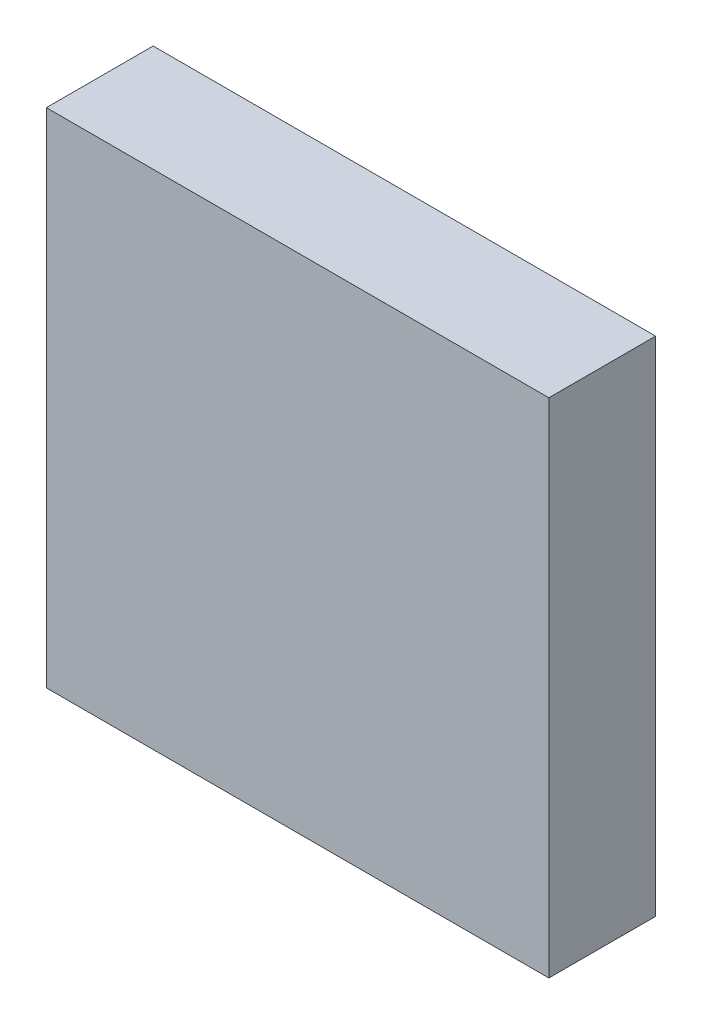
ISO-10303-21;
HEADER;
FILE_DESCRIPTION(('STEP AP214'),'2;1');
FILE_NAME('part.step','',(''),(''),'','','');
FILE_SCHEMA(('AUTOMOTIVE_DESIGN { 1 0 10303 214 1 1 1 1 }'));
ENDSEC;
DATA;
#1=APPLICATION_CONTEXT('core data for automotive mechanical design processes');
#2=APPLICATION_PROTOCOL_DEFINITION('international standard','automotive_design',2000,#1);
#3=PRODUCT_CONTEXT('',#1,'mechanical');
#4=PRODUCT('Part','Part','',(#3));
#5=PRODUCT_RELATED_PRODUCT_CATEGORY('part','',(#4));
#6=PRODUCT_DEFINITION_FORMATION('','',#4);
#7=PRODUCT_DEFINITION_CONTEXT('part definition',#1,'design');
#8=PRODUCT_DEFINITION('design','',#6,#7);
#9=PRODUCT_DEFINITION_SHAPE('','',#8);
#10=(LENGTH_UNIT() NAMED_UNIT(*) SI_UNIT(.MILLI.,.METRE.));
#11=(NAMED_UNIT(*) PLANE_ANGLE_UNIT() SI_UNIT($,.RADIAN.));
#12=(NAMED_UNIT(*) SI_UNIT($,.STERADIAN.) SOLID_ANGLE_UNIT());
#13=UNCERTAINTY_MEASURE_WITH_UNIT(LENGTH_MEASURE(1.E-05),#10,'distance_accuracy_value','');
#14=(GEOMETRIC_REPRESENTATION_CONTEXT(3) GLOBAL_UNCERTAINTY_ASSIGNED_CONTEXT((#13)) GLOBAL_UNIT_ASSIGNED_CONTEXT((#10,
#11,#12)) REPRESENTATION_CONTEXT('',''));
#15=CARTESIAN_POINT('',(0.,0.,0.));
#16=DIRECTION('',(0.,0.,1.));
#17=DIRECTION('',(1.,0.,0.));
#18=AXIS2_PLACEMENT_3D('',#15,#16,#17);
#19=CARTESIAN_POINT('',(2.00000108,-1.99999854,0.85000084));
#20=DIRECTION('',(0.,0.,-1.));
#21=DIRECTION('',(-1.,0.,0.));
#22=AXIS2_PLACEMENT_3D('',#19,#20,#21);
#23=PLANE('',#22);
#24=DIRECTION('',(1.,0.,0.));
#25=VECTOR('',#24,1.);
#26=CARTESIAN_POINT('',(2.00000108,2.00000108,0.85000084));
#27=LINE('',#26,#25);
#28=CARTESIAN_POINT('',(2.00000108,2.00000108,0.85000084));
#29=VERTEX_POINT('',#28);
#30=CARTESIAN_POINT('',(-1.99999854,2.00000108,0.85000084));
#31=VERTEX_POINT('',#30);
#32=EDGE_CURVE('E54',#29,#31,#27,.F.);
#33=ORIENTED_EDGE('',*,*,#32,.T.);
#34=DIRECTION('',(0.,1.,0.));
#35=VECTOR('',#34,1.);
#36=CARTESIAN_POINT('',(-1.99999854,2.00000108,0.85000084));
#37=LINE('',#36,#35);
#38=CARTESIAN_POINT('',(-1.99999854,-1.99999854,0.85000084));
#39=VERTEX_POINT('',#38);
#40=EDGE_CURVE('E56',#31,#39,#37,.F.);
#41=ORIENTED_EDGE('',*,*,#40,.T.);
#42=DIRECTION('',(1.,0.,0.));
#43=VECTOR('',#42,1.);
#44=CARTESIAN_POINT('',(-1.99999854,-1.99999854,0.85000084));
#45=LINE('',#44,#43);
#46=CARTESIAN_POINT('',(2.00000108,-1.99999854,0.85000084));
#47=VERTEX_POINT('',#46);
#48=EDGE_CURVE('E19',#39,#47,#45,.T.);
#49=ORIENTED_EDGE('',*,*,#48,.T.);
#50=DIRECTION('',(0.,1.,0.));
#51=VECTOR('',#50,1.);
#52=CARTESIAN_POINT('',(2.00000108,-1.99999854,0.85000084));
#53=LINE('',#52,#51);
#54=EDGE_CURVE('E79',#47,#29,#53,.T.);
#55=ORIENTED_EDGE('',*,*,#54,.T.);
#56=EDGE_LOOP('',(#33,#41,#49,#55));
#57=FACE_BOUND('',#56,.T.);
#58=ADVANCED_FACE('F16',(#57),#23,.F.);
#59=CARTESIAN_POINT('',(-1.99999854,-1.99999854,0.));
#60=DIRECTION('',(0.,1.,0.));
#61=DIRECTION('',(0.,0.,1.));
#62=AXIS2_PLACEMENT_3D('',#59,#60,#61);
#63=PLANE('',#62);
#64=DIRECTION('',(0.,0.,1.));
#65=VECTOR('',#64,1.);
#66=CARTESIAN_POINT('',(2.00000108,-1.99999854,0.));
#67=LINE('',#66,#65);
#68=CARTESIAN_POINT('',(2.00000108,-1.99999854,0.));
#69=VERTEX_POINT('',#68);
#70=EDGE_CURVE('E67',#69,#47,#67,.T.);
#71=ORIENTED_EDGE('',*,*,#70,.T.);
#72=ORIENTED_EDGE('',*,*,#48,.F.);
#73=DIRECTION('',(0.,0.,-1.));
#74=VECTOR('',#73,1.);
#75=CARTESIAN_POINT('',(-1.99999854,-1.99999854,0.));
#76=LINE('',#75,#74);
#77=CARTESIAN_POINT('',(-1.99999854,-1.99999854,0.));
#78=VERTEX_POINT('',#77);
#79=EDGE_CURVE('E62',#39,#78,#76,.T.);
#80=ORIENTED_EDGE('',*,*,#79,.T.);
#81=DIRECTION('',(-1.,0.,0.));
#82=VECTOR('',#81,1.);
#83=CARTESIAN_POINT('',(2.00000108,-1.99999854,0.));
#84=LINE('',#83,#82);
#85=EDGE_CURVE('E82',#69,#78,#84,.T.);
#86=ORIENTED_EDGE('',*,*,#85,.F.);
#87=EDGE_LOOP('',(#71,#72,#80,#86));
#88=FACE_BOUND('',#87,.T.);
#89=ADVANCED_FACE('F64',(#88),#63,.F.);
#90=CARTESIAN_POINT('',(-1.99999854,2.00000108,0.));
#91=DIRECTION('',(1.,0.,0.));
#92=DIRECTION('',(0.,0.,-1.));
#93=AXIS2_PLACEMENT_3D('',#90,#91,#92);
#94=PLANE('',#93);
#95=ORIENTED_EDGE('',*,*,#79,.F.);
#96=ORIENTED_EDGE('',*,*,#40,.F.);
#97=DIRECTION('',(0.,0.,-1.));
#98=VECTOR('',#97,1.);
#99=CARTESIAN_POINT('',(-1.99999854,2.00000108,0.));
#100=LINE('',#99,#98);
#101=CARTESIAN_POINT('',(-1.99999854,2.00000108,0.));
#102=VERTEX_POINT('',#101);
#103=EDGE_CURVE('E74',#31,#102,#100,.T.);
#104=ORIENTED_EDGE('',*,*,#103,.T.);
#105=DIRECTION('',(0.,1.,0.));
#106=VECTOR('',#105,1.);
#107=CARTESIAN_POINT('',(-1.99999854,-1.99999854,0.));
#108=LINE('',#107,#106);
#109=EDGE_CURVE('E71',#78,#102,#108,.T.);
#110=ORIENTED_EDGE('',*,*,#109,.F.);
#111=EDGE_LOOP('',(#95,#96,#104,#110));
#112=FACE_BOUND('',#111,.T.);
#113=ADVANCED_FACE('F69',(#112),#94,.F.);
#114=CARTESIAN_POINT('',(2.00000108,2.00000108,0.));
#115=DIRECTION('',(0.,-1.,0.));
#116=DIRECTION('',(0.,0.,-1.));
#117=AXIS2_PLACEMENT_3D('',#114,#115,#116);
#118=PLANE('',#117);
#119=ORIENTED_EDGE('',*,*,#103,.F.);
#120=ORIENTED_EDGE('',*,*,#32,.F.);
#121=DIRECTION('',(0.,0.,1.));
#122=VECTOR('',#121,1.);
#123=CARTESIAN_POINT('',(2.00000108,2.00000108,0.));
#124=LINE('',#123,#122);
#125=CARTESIAN_POINT('',(2.00000108,2.00000108,0.));
#126=VERTEX_POINT('',#125);
#127=EDGE_CURVE('E34',#29,#126,#124,.F.);
#128=ORIENTED_EDGE('',*,*,#127,.T.);
#129=DIRECTION('',(-1.,0.,0.));
#130=VECTOR('',#129,1.);
#131=CARTESIAN_POINT('',(2.00000108,2.00000108,0.));
#132=LINE('',#131,#130);
#133=EDGE_CURVE('E25',#102,#126,#132,.F.);
#134=ORIENTED_EDGE('',*,*,#133,.F.);
#135=EDGE_LOOP('',(#119,#120,#128,#134));
#136=FACE_BOUND('',#135,.T.);
#137=ADVANCED_FACE('F88',(#136),#118,.F.);
#138=CARTESIAN_POINT('',(2.00000108,-1.99999854,0.));
#139=DIRECTION('',(-1.,0.,0.));
#140=DIRECTION('',(0.,0.,1.));
#141=AXIS2_PLACEMENT_3D('',#138,#139,#140);
#142=PLANE('',#141);
#143=ORIENTED_EDGE('',*,*,#127,.F.);
#144=ORIENTED_EDGE('',*,*,#54,.F.);
#145=ORIENTED_EDGE('',*,*,#70,.F.);
#146=DIRECTION('',(0.,1.,0.));
#147=VECTOR('',#146,1.);
#148=CARTESIAN_POINT('',(2.00000108,-1.99999854,0.));
#149=LINE('',#148,#147);
#150=EDGE_CURVE('E11',#126,#69,#149,.F.);
#151=ORIENTED_EDGE('',*,*,#150,.F.);
#152=EDGE_LOOP('',(#143,#144,#145,#151));
#153=FACE_BOUND('',#152,.T.);
#154=ADVANCED_FACE('F90',(#153),#142,.F.);
#155=CARTESIAN_POINT('',(2.00000108,-1.99999854,0.));
#156=DIRECTION('',(0.,0.,-1.));
#157=DIRECTION('',(-1.,0.,0.));
#158=AXIS2_PLACEMENT_3D('',#155,#156,#157);
#159=PLANE('',#158);
#160=ORIENTED_EDGE('',*,*,#133,.T.);
#161=ORIENTED_EDGE('',*,*,#150,.T.);
#162=ORIENTED_EDGE('',*,*,#85,.T.);
#163=ORIENTED_EDGE('',*,*,#109,.T.);
#164=EDGE_LOOP('',(#160,#161,#162,#163));
#165=FACE_BOUND('',#164,.T.);
#166=ADVANCED_FACE('F87',(#165),#159,.T.);
#167=CLOSED_SHELL('',(#58,#89,#113,#137,#154,#166));
#168=MANIFOLD_SOLID_BREP('B1',#167);
#169=ADVANCED_BREP_SHAPE_REPRESENTATION('',(#18,#168),#14);
#170=SHAPE_DEFINITION_REPRESENTATION(#9,#169);
ENDSEC;
END-ISO-10303-21;
